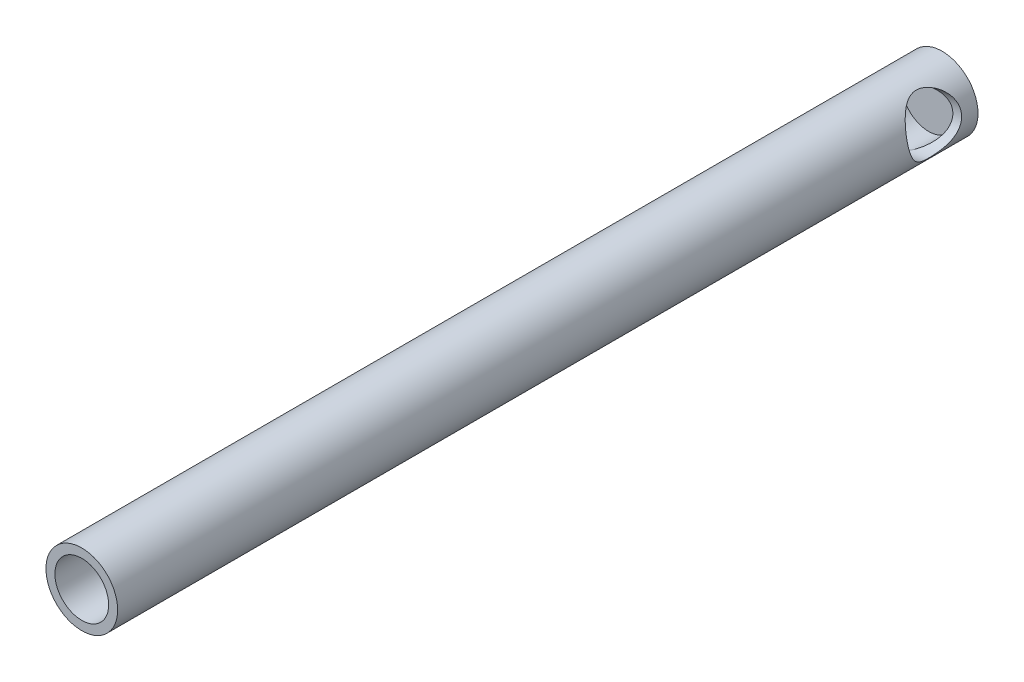
ISO-10303-21;
HEADER;
FILE_DESCRIPTION(('STEP AP214'),'2;1');
FILE_NAME('part.step','',(''),(''),'','','');
FILE_SCHEMA(('AUTOMOTIVE_DESIGN { 1 0 10303 214 1 1 1 1 }'));
ENDSEC;
DATA;
#1=APPLICATION_CONTEXT('core data for automotive mechanical design processes');
#2=APPLICATION_PROTOCOL_DEFINITION('international standard','automotive_design',2000,#1);
#3=PRODUCT_CONTEXT('',#1,'mechanical');
#4=PRODUCT('Part','Part','',(#3));
#5=PRODUCT_RELATED_PRODUCT_CATEGORY('part','',(#4));
#6=PRODUCT_DEFINITION_FORMATION('','',#4);
#7=PRODUCT_DEFINITION_CONTEXT('part definition',#1,'design');
#8=PRODUCT_DEFINITION('design','',#6,#7);
#9=PRODUCT_DEFINITION_SHAPE('','',#8);
#10=(LENGTH_UNIT() NAMED_UNIT(*) SI_UNIT(.MILLI.,.METRE.));
#11=(NAMED_UNIT(*) PLANE_ANGLE_UNIT() SI_UNIT($,.RADIAN.));
#12=(NAMED_UNIT(*) SI_UNIT($,.STERADIAN.) SOLID_ANGLE_UNIT());
#13=UNCERTAINTY_MEASURE_WITH_UNIT(LENGTH_MEASURE(1.E-05),#10,'distance_accuracy_value','');
#14=(GEOMETRIC_REPRESENTATION_CONTEXT(3) GLOBAL_UNCERTAINTY_ASSIGNED_CONTEXT((#13)) GLOBAL_UNIT_ASSIGNED_CONTEXT((#10,
#11,#12)) REPRESENTATION_CONTEXT('',''));
#15=CARTESIAN_POINT('',(0.,0.,0.));
#16=DIRECTION('',(0.,0.,1.));
#17=DIRECTION('',(1.,0.,0.));
#18=AXIS2_PLACEMENT_3D('',#15,#16,#17);
#19=CARTESIAN_POINT('',(0.,0.,76.2));
#20=DIRECTION('',(0.,0.,-1.));
#21=DIRECTION('',(-1.,0.,0.));
#22=AXIS2_PLACEMENT_3D('',#19,#20,#21);
#23=CYLINDRICAL_SURFACE('',#22,3.175);
#24=CARTESIAN_POINT('',(1.47186067757509,2.81322788728681,3.77865603575007));
#25=CARTESIAN_POINT('',(1.47185567253626,2.81322895716438,3.72306177900424));
#26=CARTESIAN_POINT('',(1.47448150533233,2.81186140084399,3.6674852968784));
#27=CARTESIAN_POINT('',(1.48480877777453,2.80642134679522,3.55693120078631));
#28=CARTESIAN_POINT('',(1.4925119108426,2.80234794658854,3.50195379284916));
#29=CARTESIAN_POINT('',(1.52272522482267,2.78612192272703,3.33851168806398));
#30=CARTESIAN_POINT('',(1.55233748950474,2.76996371010238,3.23170383973971));
#31=CARTESIAN_POINT('',(1.62498671442134,2.72795520151603,3.02681729851183));
#32=CARTESIAN_POINT('',(1.66783281896446,2.70224170182093,2.92863850180169));
#33=CARTESIAN_POINT('',(1.76246003634381,2.6415014548535,2.73989110163229));
#34=CARTESIAN_POINT('',(1.81424006906174,2.6064758331468,2.64932158017221));
#35=CARTESIAN_POINT('',(1.93463608698933,2.51881641627562,2.45767313270469));
#36=CARTESIAN_POINT('',(2.00450682808946,2.46403115060445,2.3583661231282));
#37=CARTESIAN_POINT('',(2.14748984789305,2.3404900268588,2.17127643190206));
#38=CARTESIAN_POINT('',(2.22060678100052,2.27171356692664,2.08351106262317));
#39=CARTESIAN_POINT('',(2.38113341840156,2.10400643285591,1.9040253774843));
#40=CARTESIAN_POINT('',(2.46841320908598,2.00178612488902,1.81515644335716));
#41=CARTESIAN_POINT('',(2.59346752929742,1.83288832454346,1.69868926636632));
#42=CARTESIAN_POINT('',(2.63416092677096,1.77401887983889,1.66268300802777));
#43=CARTESIAN_POINT('',(2.71280425178876,1.65124948715685,1.59681129477375));
#44=CARTESIAN_POINT('',(2.75075562369655,1.58735222519302,1.56694259137982));
#45=CARTESIAN_POINT('',(2.83738161936759,1.42862149625248,1.50346607773069));
#46=CARTESIAN_POINT('',(2.8843658521511,1.33154258234335,1.47304644335888));
#47=CARTESIAN_POINT('',(2.96904997842291,1.13016884165218,1.42694193548213));
#48=CARTESIAN_POINT('',(3.00675791712829,1.0258803689252,1.41124426032869));
#49=CARTESIAN_POINT('',(3.07129880645013,0.812522878739427,1.39546849416422));
#50=CARTESIAN_POINT('',(3.09810331947308,0.703442172189886,1.39543098931061));
#51=CARTESIAN_POINT('',(3.13985611629061,0.484144490742877,1.4110864853841));
#52=CARTESIAN_POINT('',(3.15480165298189,0.373927258558285,1.42678312918404));
#53=CARTESIAN_POINT('',(3.17275830397126,0.159456172776412,1.47214733725293));
#54=CARTESIAN_POINT('',(3.17616063620817,0.0551273645858054,1.50131798983945));
#55=CARTESIAN_POINT('',(3.17314468691358,-0.149052438669431,1.57202408175662));
#56=CARTESIAN_POINT('',(3.1667242627415,-0.248902451882713,1.61356221721783));
#57=CARTESIAN_POINT('',(3.14438875654693,-0.452855084420416,1.7125718109834));
#58=CARTESIAN_POINT('',(3.12752089418763,-0.556247531301664,1.7712814921501));
#59=CARTESIAN_POINT('',(3.08586269971062,-0.753853360467476,1.90022078778292));
#60=CARTESIAN_POINT('',(3.06106559912848,-0.848058810673448,1.97046021912146));
#61=CARTESIAN_POINT('',(3.00062507636887,-1.04369628366494,2.13594810305307));
#62=CARTESIAN_POINT('',(2.96380758506593,-1.14290434554832,2.23339815695349));
#63=CARTESIAN_POINT('',(2.88707779755935,-1.32481529452275,2.44171843696324));
#64=CARTESIAN_POINT('',(2.84716403894554,-1.40751031555694,2.55259501864993));
#65=CARTESIAN_POINT('',(2.77776143656923,-1.53917823389188,2.7642147548422));
#66=CARTESIAN_POINT('',(2.74776840580254,-1.59158518696686,2.86264797025844));
#67=CARTESIAN_POINT('',(2.69366126811593,-1.68153917146868,3.06755966990994));
#68=CARTESIAN_POINT('',(2.66953392852866,-1.7191197719661,3.17401932196224));
#69=CARTESIAN_POINT('',(2.63551124804458,-1.77072762745597,3.37175905958495));
#70=CARTESIAN_POINT('',(2.62374294654179,-1.78794682797723,3.4618657794066));
#71=CARTESIAN_POINT('',(2.60897723755289,-1.80943269589624,3.644282837506));
#72=CARTESIAN_POINT('',(2.60596860872098,-1.81371593482646,3.73659020365474));
#73=CARTESIAN_POINT('',(2.60929757710274,-1.80892103398379,3.92070393806896));
#74=CARTESIAN_POINT('',(2.61563861444025,-1.79983797620713,4.012510109448));
#75=CARTESIAN_POINT('',(2.63646042880869,-1.76918928503132,4.19311441675927));
#76=CARTESIAN_POINT('',(2.65095509786693,-1.74760234584973,4.28190714393191));
#77=CARTESIAN_POINT('',(2.69233890575532,-1.6834093641803,4.48721773852017));
#78=CARTESIAN_POINT('',(2.72183657886723,-1.63596022944493,4.60167335978766));
#79=CARTESIAN_POINT('',(2.78586956531472,-1.52436776404578,4.8205442041239));
#80=CARTESIAN_POINT('',(2.82041409788151,-1.4601937096621,4.9249404595584));
#81=CARTESIAN_POINT('',(2.89096233969851,-1.31517782125578,5.12699855413575));
#82=CARTESIAN_POINT('',(2.92697429011608,-1.23382485367479,5.22428940240463));
#83=CARTESIAN_POINT('',(2.99513359448915,-1.05771136426732,5.40743068627535));
#84=CARTESIAN_POINT('',(3.0272790577737,-0.962944332011832,5.49327552711024));
#85=CARTESIAN_POINT('',(3.090410989127,-0.73907389286504,5.66982500266304));
#86=CARTESIAN_POINT('',(3.11961474582142,-0.606989956910063,5.75750429638058));
#87=CARTESIAN_POINT('',(3.15075493441548,-0.397938539195776,5.8719798110802));
#88=CARTESIAN_POINT('',(3.15902359149862,-0.326453542442477,5.9072908739225));
#89=CARTESIAN_POINT('',(3.17071798313785,-0.180371482008224,5.97169105141308));
#90=CARTESIAN_POINT('',(3.17414633702255,-0.10577612401765,6.00078352401046));
#91=CARTESIAN_POINT('',(3.17584836270831,0.0753835160155086,6.06214891734843));
#92=CARTESIAN_POINT('',(3.171595415347,0.183086974042677,6.09125009779357));
#93=CARTESIAN_POINT('',(3.15154803166018,0.400314233075235,6.13471784058892));
#94=CARTESIAN_POINT('',(3.1357639358777,0.509836317292478,6.14909757665107));
#95=CARTESIAN_POINT('',(3.09246152997068,0.727785424542595,6.16231133279445));
#96=CARTESIAN_POINT('',(3.06491582042501,0.836209281601517,6.16110885995609));
#97=CARTESIAN_POINT('',(2.99898189383649,1.04837144540259,6.14314099053441));
#98=CARTESIAN_POINT('',(2.9605907902289,1.15210849618627,6.12637144796483));
#99=CARTESIAN_POINT('',(2.87600737268216,1.34921733888655,6.07898322081108));
#100=CARTESIAN_POINT('',(2.8300738834691,1.44280261160777,6.04878071191365));
#101=CARTESIAN_POINT('',(2.73171936789343,1.62133769765743,5.97609251757614));
#102=CARTESIAN_POINT('',(2.6792969551789,1.70628565854736,5.93360420468698));
#103=CARTESIAN_POINT('',(2.56389885307666,1.87582525431465,5.83243980044433));
#104=CARTESIAN_POINT('',(2.50040039080544,1.95928645508483,5.77247518721814));
#105=CARTESIAN_POINT('',(2.3708046411994,2.11426992371118,5.64100555636422));
#106=CARTESIAN_POINT('',(2.30470500796571,2.18578109459402,5.56948993213563));
#107=CARTESIAN_POINT('',(2.15962393434832,2.33003564081617,5.40107255157817));
#108=CARTESIAN_POINT('',(2.08068092363962,2.40022424363822,5.30194752437407));
#109=CARTESIAN_POINT('',(1.92818988454909,2.52435237043922,5.09014032382014));
#110=CARTESIAN_POINT('',(1.85464383965206,2.5782859427964,4.97745320592257));
#111=CARTESIAN_POINT('',(1.73438196723088,2.66019642936857,4.76467931137884));
#112=CARTESIAN_POINT('',(1.68530181085411,2.69126345956986,4.66712571534866));
#113=CARTESIAN_POINT('',(1.59929425491119,2.74324927109724,4.46432295055247));
#114=CARTESIAN_POINT('',(1.56233464960797,2.76419501724394,4.35909509889168));
#115=CARTESIAN_POINT('',(1.51404801739548,2.79084379715273,4.17428355584772));
#116=CARTESIAN_POINT('',(1.49838350352154,2.79921483900832,4.09622061688319));
#117=CARTESIAN_POINT('',(1.47729678654364,2.81040429434458,3.93831078333602));
#118=CARTESIAN_POINT('',(1.47186786262369,2.81322635141014,3.8584650942089));
#119=CARTESIAN_POINT('',(1.47186067757509,2.81322788728681,3.77865603575007));
#120=B_SPLINE_CURVE_WITH_KNOTS('',3,(#24,#25,#26,#27,#28,#29,#30,#31,#32,#33,#34,#35,#36,#37,
#38,#39,#40,#41,#42,#43,#44,#45,#46,#47,#48,#49,#50,#51,#52,#53,#54,#55,#56,#57,#58,#59,#60,#61,
#62,#63,#64,#65,#66,#67,#68,#69,#70,#71,#72,#73,#74,#75,#76,#77,#78,#79,#80,#81,#82,#83,#84,#85,
#86,#87,#88,#89,#90,#91,#92,#93,#94,#95,#96,#97,#98,#99,#100,#101,#102,#103,#104,#105,#106,#107,
#108,#109,#110,#111,#112,#113,#114,#115,#116,#117,#118,#119),.UNSPECIFIED.,.T.,.F.,(4,2,2,2,2,2,
2,2,2,2,2,2,2,2,2,2,2,2,2,2,2,2,2,2,2,2,2,2,2,2,2,2,2,2,2,2,2,2,2,2,2,2,2,2,2,2,2,4),(0.,
0.166670562670062,0.333396742792351,0.667339981906223,0.996675846977686,1.32597192297306,
1.72423773527801,2.1230942899363,2.60338951084345,2.84336161514468,3.08320637824507,
3.41784848633747,3.75219933200382,4.08741670286022,4.42271170336174,4.74652297239021,
5.07040488453141,5.42935574791199,5.78861383639794,6.21854443318092,6.64867934321721,
6.99403647300677,7.33860711253775,7.61488543559746,7.89080968360009,8.16683548073491,
8.44333299685558,8.82332254526934,9.2040151169528,9.59823179186099,9.99264045752135,
10.4730917771592,10.7131943430019,10.9531669275464,11.2865706233212,11.6196757061692,
11.9535610487137,12.287535340646,12.6118142977188,12.9361626566316,13.2972529795072,
13.6586767749309,14.0915987379129,14.5246790190451,14.8642460855329,15.2029034303763,
15.4423267879057,15.6815928822492),.UNSPECIFIED.);
#121=CARTESIAN_POINT('',(1.47186067757509,2.81322788728681,3.77865603575007));
#122=VERTEX_POINT('',#121);
#123=EDGE_CURVE('E65',#122,#122,#120,.T.);
#124=ORIENTED_EDGE('',*,*,#123,.T.);
#125=EDGE_LOOP('',(#124));
#126=FACE_BOUND('',#125,.T.);
#127=CARTESIAN_POINT('',(0.,0.,76.2));
#128=DIRECTION('',(0.,0.,1.));
#129=DIRECTION('',(1.,0.,0.));
#130=AXIS2_PLACEMENT_3D('',#127,#128,#129);
#131=CIRCLE('',#130,3.175);
#132=CARTESIAN_POINT('',(3.175,0.,76.2));
#133=VERTEX_POINT('',#132);
#134=EDGE_CURVE('E50',#133,#133,#131,.T.);
#135=ORIENTED_EDGE('',*,*,#134,.F.);
#136=EDGE_LOOP('',(#135));
#137=FACE_BOUND('',#136,.T.);
#138=CARTESIAN_POINT('',(0.,0.,0.));
#139=DIRECTION('',(0.,0.,1.));
#140=DIRECTION('',(1.,0.,0.));
#141=AXIS2_PLACEMENT_3D('',#138,#139,#140);
#142=CIRCLE('',#141,3.175);
#143=CARTESIAN_POINT('',(3.175,0.,0.));
#144=VERTEX_POINT('',#143);
#145=EDGE_CURVE('E67',#144,#144,#142,.T.);
#146=ORIENTED_EDGE('',*,*,#145,.T.);
#147=EDGE_LOOP('',(#146));
#148=FACE_BOUND('',#147,.T.);
#149=ADVANCED_FACE('F33',(#126,#137,#148),#23,.T.);
#150=CARTESIAN_POINT('',(0.,0.,76.2));
#151=DIRECTION('',(0.,0.,1.));
#152=DIRECTION('',(1.,0.,0.));
#153=AXIS2_PLACEMENT_3D('',#150,#151,#152);
#154=PLANE('',#153);
#155=CARTESIAN_POINT('',(0.,0.,76.2));
#156=DIRECTION('',(0.,0.,1.));
#157=DIRECTION('',(1.,0.,0.));
#158=AXIS2_PLACEMENT_3D('',#155,#156,#157);
#159=CIRCLE('',#158,2.38125);
#160=CARTESIAN_POINT('',(2.38125,0.,76.2));
#161=VERTEX_POINT('',#160);
#162=EDGE_CURVE('E63',#161,#161,#159,.T.);
#163=ORIENTED_EDGE('',*,*,#162,.F.);
#164=EDGE_LOOP('',(#163));
#165=FACE_BOUND('',#164,.T.);
#166=ORIENTED_EDGE('',*,*,#134,.T.);
#167=EDGE_LOOP('',(#166));
#168=FACE_BOUND('',#167,.T.);
#169=ADVANCED_FACE('F79',(#165,#168),#154,.T.);
#170=CARTESIAN_POINT('',(0.,0.,0.));
#171=DIRECTION('',(0.,0.,1.));
#172=DIRECTION('',(1.,0.,0.));
#173=AXIS2_PLACEMENT_3D('',#170,#171,#172);
#174=PLANE('',#173);
#175=ORIENTED_EDGE('',*,*,#145,.F.);
#176=EDGE_LOOP('',(#175));
#177=FACE_BOUND('',#176,.T.);
#178=ADVANCED_FACE('F55',(#177),#174,.F.);
#179=CARTESIAN_POINT('',(0.,0.,1.19999999999997));
#180=DIRECTION('',(0.,0.,1.));
#181=DIRECTION('',(1.,0.,0.));
#182=AXIS2_PLACEMENT_3D('',#179,#180,#181);
#183=CYLINDRICAL_SURFACE('',#182,2.38125);
#184=CARTESIAN_POINT('',(0.,0.,3.77865603575007));
#185=DIRECTION('',(-0.686721002885534,-0.168565311365912,0.707106781186547));
#186=DIRECTION('',(0.686721002885534,0.168565311365912,0.707106781186547));
#187=AXIS2_PLACEMENT_3D('',#184,#185,#186);
#188=ELLIPSE('',#187,3.36759604540093,2.38125);
#189=CARTESIAN_POINT('',(-0.56765987594762,2.31259893361108,3.77865603575007));
#190=VERTEX_POINT('',#189);
#191=CARTESIAN_POINT('',(0.56765987594762,-2.31259893361108,3.77865603575007));
#192=VERTEX_POINT('',#191);
#193=EDGE_CURVE('E41',#190,#192,#188,.F.);
#194=ORIENTED_EDGE('',*,*,#193,.T.);
#195=CARTESIAN_POINT('',(0.,0.,3.77865603575007));
#196=DIRECTION('',(0.686721002885534,0.168565311365912,0.707106781186547));
#197=DIRECTION('',(-0.686721002885534,-0.168565311365912,0.707106781186547));
#198=AXIS2_PLACEMENT_3D('',#195,#196,#197);
#199=ELLIPSE('',#198,3.36759604540093,2.38125);
#200=EDGE_CURVE('E11',#192,#190,#199,.T.);
#201=ORIENTED_EDGE('',*,*,#200,.T.);
#202=EDGE_LOOP('',(#194,#201));
#203=FACE_BOUND('',#202,.T.);
#204=CARTESIAN_POINT('',(0.,0.,1.19999999999997));
#205=DIRECTION('',(0.,0.,1.));
#206=DIRECTION('',(1.,0.,0.));
#207=AXIS2_PLACEMENT_3D('',#204,#205,#206);
#208=CIRCLE('',#207,2.38125);
#209=CARTESIAN_POINT('',(2.38125,0.,1.19999999999997));
#210=VERTEX_POINT('',#209);
#211=EDGE_CURVE('E60',#210,#210,#208,.T.);
#212=ORIENTED_EDGE('',*,*,#211,.F.);
#213=EDGE_LOOP('',(#212));
#214=FACE_BOUND('',#213,.T.);
#215=ORIENTED_EDGE('',*,*,#162,.T.);
#216=EDGE_LOOP('',(#215));
#217=FACE_BOUND('',#216,.T.);
#218=ADVANCED_FACE('F51',(#203,#214,#217),#183,.F.);
#219=CARTESIAN_POINT('',(0.,0.,1.19999999999997));
#220=DIRECTION('',(0.,0.,1.));
#221=DIRECTION('',(1.,0.,0.));
#222=AXIS2_PLACEMENT_3D('',#219,#220,#221);
#223=PLANE('',#222);
#224=ORIENTED_EDGE('',*,*,#211,.T.);
#225=EDGE_LOOP('',(#224));
#226=FACE_BOUND('',#225,.T.);
#227=ADVANCED_FACE('F54',(#226),#223,.T.);
#228=CARTESIAN_POINT('',(3.08346524481476,0.756879834596824,3.77865603575007));
#229=DIRECTION('',(0.971170155847175,0.238387349479316,0.));
#230=DIRECTION('',(-0.238387349479316,0.971170155847175,0.));
#231=AXIS2_PLACEMENT_3D('',#228,#229,#230);
#232=CYLINDRICAL_SURFACE('',#231,2.38124999999999);
#233=ORIENTED_EDGE('',*,*,#193,.F.);
#234=ORIENTED_EDGE('',*,*,#200,.F.);
#235=EDGE_LOOP('',(#233,#234));
#236=FACE_BOUND('',#235,.T.);
#237=ORIENTED_EDGE('',*,*,#123,.F.);
#238=EDGE_LOOP('',(#237));
#239=FACE_BOUND('',#238,.T.);
#240=ADVANCED_FACE('F47',(#236,#239),#232,.F.);
#241=CLOSED_SHELL('',(#149,#169,#178,#218,#227,#240));
#242=MANIFOLD_SOLID_BREP('B2',#241);
#243=ADVANCED_BREP_SHAPE_REPRESENTATION('',(#18,#242),#14);
#244=SHAPE_DEFINITION_REPRESENTATION(#9,#243);
ENDSEC;
END-ISO-10303-21;
